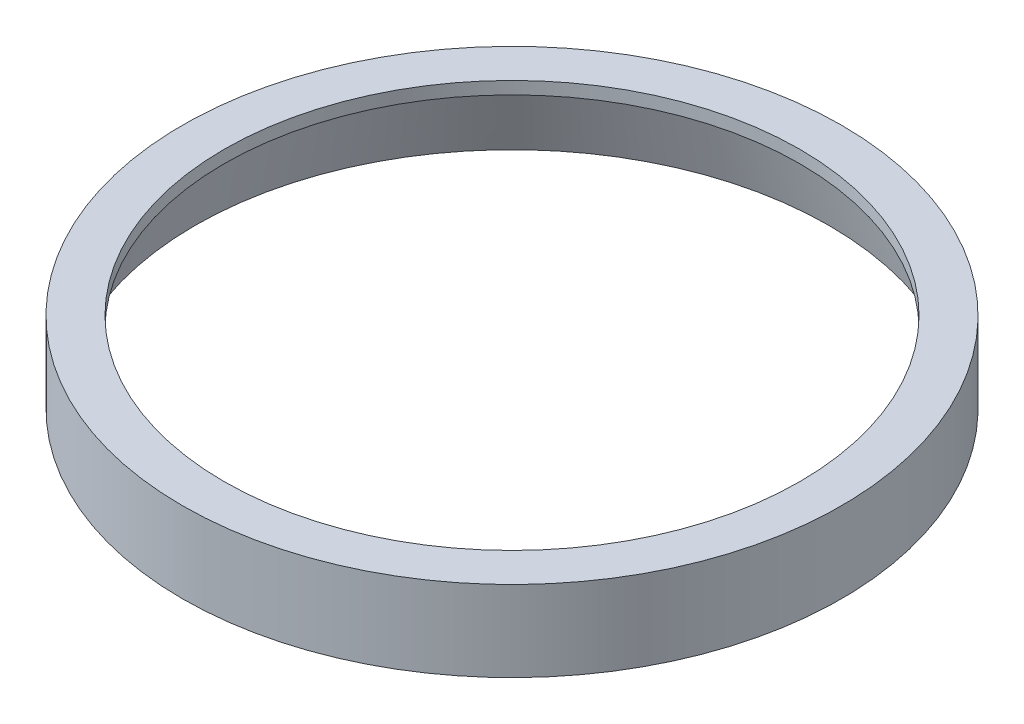
ISO-10303-21;
HEADER;
FILE_DESCRIPTION(('STEP AP214'),'2;1');
FILE_NAME('part.step','',(''),(''),'','','');
FILE_SCHEMA(('AUTOMOTIVE_DESIGN { 1 0 10303 214 1 1 1 1 }'));
ENDSEC;
DATA;
#1=APPLICATION_CONTEXT('core data for automotive mechanical design processes');
#2=APPLICATION_PROTOCOL_DEFINITION('international standard','automotive_design',2000,#1);
#3=PRODUCT_CONTEXT('',#1,'mechanical');
#4=PRODUCT('Part','Part','',(#3));
#5=PRODUCT_RELATED_PRODUCT_CATEGORY('part','',(#4));
#6=PRODUCT_DEFINITION_FORMATION('','',#4);
#7=PRODUCT_DEFINITION_CONTEXT('part definition',#1,'design');
#8=PRODUCT_DEFINITION('design','',#6,#7);
#9=PRODUCT_DEFINITION_SHAPE('','',#8);
#10=(LENGTH_UNIT() NAMED_UNIT(*) SI_UNIT(.MILLI.,.METRE.));
#11=(NAMED_UNIT(*) PLANE_ANGLE_UNIT() SI_UNIT($,.RADIAN.));
#12=(NAMED_UNIT(*) SI_UNIT($,.STERADIAN.) SOLID_ANGLE_UNIT());
#13=UNCERTAINTY_MEASURE_WITH_UNIT(LENGTH_MEASURE(1.E-05),#10,'distance_accuracy_value','');
#14=(GEOMETRIC_REPRESENTATION_CONTEXT(3) GLOBAL_UNCERTAINTY_ASSIGNED_CONTEXT((#13)) GLOBAL_UNIT_ASSIGNED_CONTEXT((#10,
#11,#12)) REPRESENTATION_CONTEXT('',''));
#15=CARTESIAN_POINT('',(0.,0.,0.));
#16=DIRECTION('',(0.,0.,1.));
#17=DIRECTION('',(1.,0.,0.));
#18=AXIS2_PLACEMENT_3D('',#15,#16,#17);
#19=CARTESIAN_POINT('',(38.,2.33377544122467,0.));
#20=DIRECTION('',(0.,-1.,0.));
#21=DIRECTION('',(0.,0.,-1.));
#22=AXIS2_PLACEMENT_3D('',#19,#20,#21);
#23=PLANE('',#22);
#24=CARTESIAN_POINT('',(0.,2.33377544122467,0.));
#25=DIRECTION('',(0.,-1.,0.));
#26=DIRECTION('',(0.,0.,-1.));
#27=AXIS2_PLACEMENT_3D('',#24,#25,#26);
#28=CIRCLE('',#27,39.5);
#29=CARTESIAN_POINT('',(0.,2.33377544122467,-39.5));
#30=VERTEX_POINT('',#29);
#31=EDGE_CURVE('E53',#30,#30,#28,.T.);
#32=ORIENTED_EDGE('',*,*,#31,.T.);
#33=EDGE_LOOP('',(#32));
#34=FACE_BOUND('',#33,.T.);
#35=CARTESIAN_POINT('',(0.,2.33377544122467,0.));
#36=DIRECTION('',(0.,-1.,0.));
#37=DIRECTION('',(0.,0.,-1.));
#38=AXIS2_PLACEMENT_3D('',#35,#36,#37);
#39=CIRCLE('',#38,38.);
#40=CARTESIAN_POINT('',(0.,2.33377544122467,-38.));
#41=VERTEX_POINT('',#40);
#42=EDGE_CURVE('E10',#41,#41,#39,.T.);
#43=ORIENTED_EDGE('',*,*,#42,.F.);
#44=EDGE_LOOP('',(#43));
#45=FACE_BOUND('',#44,.T.);
#46=ADVANCED_FACE('F31',(#34,#45),#23,.T.);
#47=CARTESIAN_POINT('',(0.,10.048680428723,0.));
#48=DIRECTION('',(0.,-1.,0.));
#49=DIRECTION('',(0.,0.,-1.));
#50=AXIS2_PLACEMENT_3D('',#47,#48,#49);
#51=CONICAL_SURFACE('',#50,35.932797438917,0.261799387799143);
#52=ORIENTED_EDGE('',*,*,#42,.T.);
#53=EDGE_LOOP('',(#52));
#54=FACE_BOUND('',#53,.T.);
#55=CARTESIAN_POINT('',(0.,10.048680428723,0.));
#56=DIRECTION('',(0.,-1.,0.));
#57=DIRECTION('',(0.,0.,-1.));
#58=AXIS2_PLACEMENT_3D('',#55,#56,#57);
#59=CIRCLE('',#58,35.932797438917);
#60=CARTESIAN_POINT('',(0.,10.048680428723,-35.932797438917));
#61=VERTEX_POINT('',#60);
#62=EDGE_CURVE('E37',#61,#61,#59,.T.);
#63=ORIENTED_EDGE('',*,*,#62,.F.);
#64=EDGE_LOOP('',(#63));
#65=FACE_BOUND('',#64,.T.);
#66=ADVANCED_FACE('F71',(#54,#65),#51,.F.);
#67=CARTESIAN_POINT('',(0.,8.,0.));
#68=DIRECTION('',(0.,-1.,0.));
#69=DIRECTION('',(0.,0.,-1.));
#70=AXIS2_PLACEMENT_3D('',#67,#68,#69);
#71=TOROIDAL_SURFACE('',#70,34.5,2.5);
#72=ORIENTED_EDGE('',*,*,#62,.T.);
#73=EDGE_LOOP('',(#72));
#74=FACE_BOUND('',#73,.T.);
#75=CARTESIAN_POINT('',(0.,10.5,0.));
#76=DIRECTION('',(0.,-1.,0.));
#77=DIRECTION('',(0.,0.,-1.));
#78=AXIS2_PLACEMENT_3D('',#75,#76,#77);
#79=CIRCLE('',#78,34.5);
#80=CARTESIAN_POINT('',(0.,10.5,-34.5));
#81=VERTEX_POINT('',#80);
#82=EDGE_CURVE('E41',#81,#81,#79,.T.);
#83=ORIENTED_EDGE('',*,*,#82,.F.);
#84=EDGE_LOOP('',(#83));
#85=FACE_BOUND('',#84,.T.);
#86=ADVANCED_FACE('F75',(#74,#85),#71,.F.);
#87=CARTESIAN_POINT('',(0.,0.,0.));
#88=DIRECTION('',(0.,-1.,0.));
#89=DIRECTION('',(0.,0.,-1.));
#90=AXIS2_PLACEMENT_3D('',#87,#88,#89);
#91=CYLINDRICAL_SURFACE('',#90,34.5);
#92=ORIENTED_EDGE('',*,*,#82,.T.);
#93=EDGE_LOOP('',(#92));
#94=FACE_BOUND('',#93,.T.);
#95=CARTESIAN_POINT('',(0.,12.,0.));
#96=DIRECTION('',(0.,-1.,0.));
#97=DIRECTION('',(0.,0.,-1.));
#98=AXIS2_PLACEMENT_3D('',#95,#96,#97);
#99=CIRCLE('',#98,34.5);
#100=CARTESIAN_POINT('',(0.,12.,-34.5));
#101=VERTEX_POINT('',#100);
#102=EDGE_CURVE('E45',#101,#101,#99,.T.);
#103=ORIENTED_EDGE('',*,*,#102,.F.);
#104=EDGE_LOOP('',(#103));
#105=FACE_BOUND('',#104,.T.);
#106=ADVANCED_FACE('F67',(#94,#105),#91,.F.);
#107=CARTESIAN_POINT('',(39.5,12.,0.));
#108=DIRECTION('',(0.,1.,0.));
#109=DIRECTION('',(0.,0.,1.));
#110=AXIS2_PLACEMENT_3D('',#107,#108,#109);
#111=PLANE('',#110);
#112=ORIENTED_EDGE('',*,*,#102,.T.);
#113=EDGE_LOOP('',(#112));
#114=FACE_BOUND('',#113,.T.);
#115=CARTESIAN_POINT('',(0.,12.,0.));
#116=DIRECTION('',(0.,-1.,0.));
#117=DIRECTION('',(0.,0.,-1.));
#118=AXIS2_PLACEMENT_3D('',#115,#116,#117);
#119=CIRCLE('',#118,39.5);
#120=CARTESIAN_POINT('',(0.,12.,-39.5));
#121=VERTEX_POINT('',#120);
#122=EDGE_CURVE('E50',#121,#121,#119,.T.);
#123=ORIENTED_EDGE('',*,*,#122,.F.);
#124=EDGE_LOOP('',(#123));
#125=FACE_BOUND('',#124,.T.);
#126=ADVANCED_FACE('F61',(#114,#125),#111,.T.);
#127=CARTESIAN_POINT('',(0.,0.,0.));
#128=DIRECTION('',(0.,-1.,0.));
#129=DIRECTION('',(0.,0.,-1.));
#130=AXIS2_PLACEMENT_3D('',#127,#128,#129);
#131=CYLINDRICAL_SURFACE('',#130,39.5);
#132=ORIENTED_EDGE('',*,*,#122,.T.);
#133=EDGE_LOOP('',(#132));
#134=FACE_BOUND('',#133,.T.);
#135=ORIENTED_EDGE('',*,*,#31,.F.);
#136=EDGE_LOOP('',(#135));
#137=FACE_BOUND('',#136,.T.);
#138=ADVANCED_FACE('F59',(#134,#137),#131,.T.);
#139=CLOSED_SHELL('',(#46,#66,#86,#106,#126,#138));
#140=MANIFOLD_SOLID_BREP('B2',#139);
#141=ADVANCED_BREP_SHAPE_REPRESENTATION('',(#18,#140),#14);
#142=SHAPE_DEFINITION_REPRESENTATION(#9,#141);
ENDSEC;
END-ISO-10303-21;
